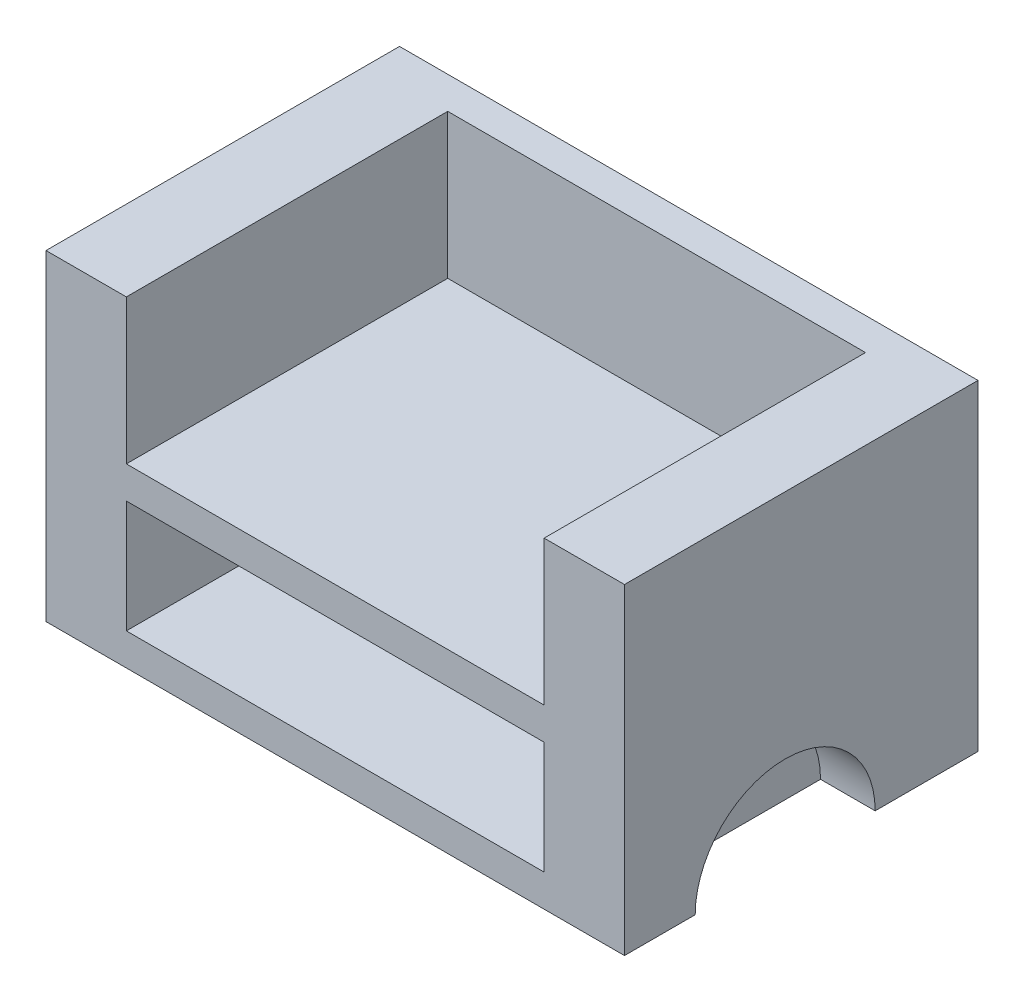
ISO-10303-21;
HEADER;
FILE_DESCRIPTION(('STEP AP214'),'2;1');
FILE_NAME('part.step','',(''),(''),'','','');
FILE_SCHEMA(('AUTOMOTIVE_DESIGN { 1 0 10303 214 1 1 1 1 }'));
ENDSEC;
DATA;
#1=APPLICATION_CONTEXT('core data for automotive mechanical design processes');
#2=APPLICATION_PROTOCOL_DEFINITION('international standard','automotive_design',2000,#1);
#3=PRODUCT_CONTEXT('',#1,'mechanical');
#4=PRODUCT('Part','Part','',(#3));
#5=PRODUCT_RELATED_PRODUCT_CATEGORY('part','',(#4));
#6=PRODUCT_DEFINITION_FORMATION('','',#4);
#7=PRODUCT_DEFINITION_CONTEXT('part definition',#1,'design');
#8=PRODUCT_DEFINITION('design','',#6,#7);
#9=PRODUCT_DEFINITION_SHAPE('','',#8);
#10=(LENGTH_UNIT() NAMED_UNIT(*) SI_UNIT(.MILLI.,.METRE.));
#11=(NAMED_UNIT(*) PLANE_ANGLE_UNIT() SI_UNIT($,.RADIAN.));
#12=(NAMED_UNIT(*) SI_UNIT($,.STERADIAN.) SOLID_ANGLE_UNIT());
#13=UNCERTAINTY_MEASURE_WITH_UNIT(LENGTH_MEASURE(1.E-05),#10,'distance_accuracy_value','');
#14=(GEOMETRIC_REPRESENTATION_CONTEXT(3) GLOBAL_UNCERTAINTY_ASSIGNED_CONTEXT((#13)) GLOBAL_UNIT_ASSIGNED_CONTEXT((#10,
#11,#12)) REPRESENTATION_CONTEXT('',''));
#15=CARTESIAN_POINT('',(0.,0.,0.));
#16=DIRECTION('',(0.,0.,1.));
#17=DIRECTION('',(1.,0.,0.));
#18=AXIS2_PLACEMENT_3D('',#15,#16,#17);
#19=CARTESIAN_POINT('',(25.,10.,-110.));
#20=DIRECTION('',(-1.,0.,0.));
#21=DIRECTION('',(0.,0.,1.));
#22=AXIS2_PLACEMENT_3D('',#19,#20,#21);
#23=PLANE('',#22);
#24=DIRECTION('',(0.,0.,-1.));
#25=VECTOR('',#24,1.);
#26=CARTESIAN_POINT('',(25.,45.,-9.99999999999999));
#27=LINE('',#26,#25);
#28=CARTESIAN_POINT('',(25.,45.,-10.));
#29=VERTEX_POINT('',#28);
#30=CARTESIAN_POINT('',(25.,45.,-110.));
#31=VERTEX_POINT('',#30);
#32=EDGE_CURVE('E199',#29,#31,#27,.T.);
#33=ORIENTED_EDGE('',*,*,#32,.F.);
#34=DIRECTION('',(0.,1.,0.));
#35=VECTOR('',#34,1.);
#36=CARTESIAN_POINT('',(25.,10.,-10.));
#37=LINE('',#36,#35);
#38=CARTESIAN_POINT('',(25.,10.,-10.));
#39=VERTEX_POINT('',#38);
#40=EDGE_CURVE('E170',#39,#29,#37,.T.);
#41=ORIENTED_EDGE('',*,*,#40,.F.);
#42=DIRECTION('',(0.,0.,1.));
#43=VECTOR('',#42,1.);
#44=CARTESIAN_POINT('',(25.,10.,-110.));
#45=LINE('',#44,#43);
#46=CARTESIAN_POINT('',(25.,10.,-110.));
#47=VERTEX_POINT('',#46);
#48=EDGE_CURVE('E253',#47,#39,#45,.T.);
#49=ORIENTED_EDGE('',*,*,#48,.F.);
#50=DIRECTION('',(0.,1.,0.));
#51=VECTOR('',#50,1.);
#52=CARTESIAN_POINT('',(25.,10.,-110.));
#53=LINE('',#52,#51);
#54=EDGE_CURVE('E280',#47,#31,#53,.T.);
#55=ORIENTED_EDGE('',*,*,#54,.T.);
#56=EDGE_LOOP('',(#33,#41,#49,#55));
#57=FACE_BOUND('',#56,.T.);
#58=ADVANCED_FACE('F43',(#57),#23,.F.);
#59=DIRECTION('',(0.,0.,-1.));
#60=VECTOR('',#59,1.);
#61=CARTESIAN_POINT('',(25.,55.,-9.99999999999999));
#62=LINE('',#61,#60);
#63=CARTESIAN_POINT('',(25.,55.,-10.));
#64=VERTEX_POINT('',#63);
#65=CARTESIAN_POINT('',(25.,55.,-110.));
#66=VERTEX_POINT('',#65);
#67=EDGE_CURVE('E59',#64,#66,#62,.T.);
#68=ORIENTED_EDGE('',*,*,#67,.T.);
#69=CARTESIAN_POINT('',(25.,100.,-110.));
#70=VERTEX_POINT('',#69);
#71=EDGE_CURVE('E284',#66,#70,#53,.T.);
#72=ORIENTED_EDGE('',*,*,#71,.T.);
#73=DIRECTION('',(0.,0.,1.));
#74=VECTOR('',#73,1.);
#75=CARTESIAN_POINT('',(25.,100.,-110.));
#76=LINE('',#75,#74);
#77=CARTESIAN_POINT('',(25.,100.,-10.));
#78=VERTEX_POINT('',#77);
#79=EDGE_CURVE('E249',#70,#78,#76,.T.);
#80=ORIENTED_EDGE('',*,*,#79,.T.);
#81=EDGE_CURVE('E270',#64,#78,#37,.T.);
#82=ORIENTED_EDGE('',*,*,#81,.F.);
#83=EDGE_LOOP('',(#68,#72,#80,#82));
#84=FACE_BOUND('',#83,.T.);
#85=ADVANCED_FACE('F368',(#84),#23,.F.);
#86=CARTESIAN_POINT('',(25.,10.,-110.));
#87=DIRECTION('',(0.,0.,-1.));
#88=DIRECTION('',(-1.,0.,0.));
#89=AXIS2_PLACEMENT_3D('',#86,#87,#88);
#90=PLANE('',#89);
#91=DIRECTION('',(1.,0.,0.));
#92=VECTOR('',#91,1.);
#93=CARTESIAN_POINT('',(25.,45.,-110.));
#94=LINE('',#93,#92);
#95=CARTESIAN_POINT('',(155.,45.,-110.));
#96=VERTEX_POINT('',#95);
#97=EDGE_CURVE('E67',#31,#96,#94,.T.);
#98=ORIENTED_EDGE('',*,*,#97,.F.);
#99=ORIENTED_EDGE('',*,*,#54,.F.);
#100=DIRECTION('',(-1.,0.,0.));
#101=VECTOR('',#100,1.);
#102=CARTESIAN_POINT('',(25.,10.,-110.));
#103=LINE('',#102,#101);
#104=CARTESIAN_POINT('',(155.,10.,-110.));
#105=VERTEX_POINT('',#104);
#106=EDGE_CURVE('E266',#105,#47,#103,.T.);
#107=ORIENTED_EDGE('',*,*,#106,.F.);
#108=DIRECTION('',(0.,1.,0.));
#109=VECTOR('',#108,1.);
#110=CARTESIAN_POINT('',(155.,10.,-110.));
#111=LINE('',#110,#109);
#112=EDGE_CURVE('E285',#105,#96,#111,.T.);
#113=ORIENTED_EDGE('',*,*,#112,.T.);
#114=EDGE_LOOP('',(#98,#99,#107,#113));
#115=FACE_BOUND('',#114,.T.);
#116=ADVANCED_FACE('F374',(#115),#90,.F.);
#117=DIRECTION('',(-1.,0.,0.));
#118=VECTOR('',#117,1.);
#119=CARTESIAN_POINT('',(25.,55.,-110.));
#120=LINE('',#119,#118);
#121=CARTESIAN_POINT('',(155.,55.,-110.));
#122=VERTEX_POINT('',#121);
#123=EDGE_CURVE('E190',#122,#66,#120,.T.);
#124=ORIENTED_EDGE('',*,*,#123,.F.);
#125=CARTESIAN_POINT('',(155.,100.,-110.));
#126=VERTEX_POINT('',#125);
#127=EDGE_CURVE('E176',#122,#126,#111,.T.);
#128=ORIENTED_EDGE('',*,*,#127,.T.);
#129=DIRECTION('',(-1.,0.,0.));
#130=VECTOR('',#129,1.);
#131=CARTESIAN_POINT('',(25.,100.,-110.));
#132=LINE('',#131,#130);
#133=EDGE_CURVE('E258',#126,#70,#132,.T.);
#134=ORIENTED_EDGE('',*,*,#133,.T.);
#135=ORIENTED_EDGE('',*,*,#71,.F.);
#136=EDGE_LOOP('',(#124,#128,#134,#135));
#137=FACE_BOUND('',#136,.T.);
#138=ADVANCED_FACE('F394',(#137),#90,.F.);
#139=CARTESIAN_POINT('',(155.,10.,-110.));
#140=DIRECTION('',(1.,0.,0.));
#141=DIRECTION('',(0.,0.,-1.));
#142=AXIS2_PLACEMENT_3D('',#139,#140,#141);
#143=PLANE('',#142);
#144=DIRECTION('',(0.,0.,-1.));
#145=VECTOR('',#144,1.);
#146=CARTESIAN_POINT('',(155.,45.,-9.99999999999999));
#147=LINE('',#146,#145);
#148=CARTESIAN_POINT('',(155.,45.,-10.));
#149=VERTEX_POINT('',#148);
#150=EDGE_CURVE('E180',#149,#96,#147,.T.);
#151=ORIENTED_EDGE('',*,*,#150,.T.);
#152=ORIENTED_EDGE('',*,*,#112,.F.);
#153=DIRECTION('',(0.,0.,-1.));
#154=VECTOR('',#153,1.);
#155=CARTESIAN_POINT('',(155.,10.,-110.));
#156=LINE('',#155,#154);
#157=CARTESIAN_POINT('',(155.,10.,-10.));
#158=VERTEX_POINT('',#157);
#159=EDGE_CURVE('E262',#158,#105,#156,.T.);
#160=ORIENTED_EDGE('',*,*,#159,.F.);
#161=DIRECTION('',(0.,1.,0.));
#162=VECTOR('',#161,1.);
#163=CARTESIAN_POINT('',(155.,10.,-10.));
#164=LINE('',#163,#162);
#165=EDGE_CURVE('E169',#158,#149,#164,.T.);
#166=ORIENTED_EDGE('',*,*,#165,.T.);
#167=EDGE_LOOP('',(#151,#152,#160,#166));
#168=FACE_BOUND('',#167,.T.);
#169=ADVANCED_FACE('F377',(#168),#143,.F.);
#170=DIRECTION('',(0.,0.,-1.));
#171=VECTOR('',#170,1.);
#172=CARTESIAN_POINT('',(155.,55.,-9.99999999999999));
#173=LINE('',#172,#171);
#174=CARTESIAN_POINT('',(155.,55.,-9.99999999999999));
#175=VERTEX_POINT('',#174);
#176=EDGE_CURVE('E174',#175,#122,#173,.T.);
#177=ORIENTED_EDGE('',*,*,#176,.F.);
#178=CARTESIAN_POINT('',(155.,100.,-10.));
#179=VERTEX_POINT('',#178);
#180=EDGE_CURVE('E158',#175,#179,#164,.T.);
#181=ORIENTED_EDGE('',*,*,#180,.T.);
#182=DIRECTION('',(0.,0.,-1.));
#183=VECTOR('',#182,1.);
#184=CARTESIAN_POINT('',(155.,100.,-110.));
#185=LINE('',#184,#183);
#186=EDGE_CURVE('E274',#179,#126,#185,.T.);
#187=ORIENTED_EDGE('',*,*,#186,.T.);
#188=ORIENTED_EDGE('',*,*,#127,.F.);
#189=EDGE_LOOP('',(#177,#181,#187,#188));
#190=FACE_BOUND('',#189,.T.);
#191=ADVANCED_FACE('F175',(#190),#143,.F.);
#192=CARTESIAN_POINT('',(0.,100.,-120.));
#193=DIRECTION('',(1.,0.,0.));
#194=DIRECTION('',(0.,0.,-1.));
#195=AXIS2_PLACEMENT_3D('',#192,#193,#194);
#196=PLANE('',#195);
#197=DIRECTION('',(0.,0.,1.));
#198=VECTOR('',#197,1.);
#199=CARTESIAN_POINT('',(0.,0.,-120.));
#200=LINE('',#199,#198);
#201=CARTESIAN_POINT('',(0.,0.,-32.));
#202=VERTEX_POINT('',#201);
#203=CARTESIAN_POINT('',(0.,0.,-10.));
#204=VERTEX_POINT('',#203);
#205=EDGE_CURVE('E283',#202,#204,#200,.T.);
#206=ORIENTED_EDGE('',*,*,#205,.T.);
#207=DIRECTION('',(0.,1.,0.));
#208=VECTOR('',#207,1.);
#209=CARTESIAN_POINT('',(0.,0.,-10.));
#210=LINE('',#209,#208);
#211=CARTESIAN_POINT('',(0.,100.,-10.));
#212=VERTEX_POINT('',#211);
#213=EDGE_CURVE('E211',#204,#212,#210,.T.);
#214=ORIENTED_EDGE('',*,*,#213,.T.);
#215=DIRECTION('',(0.,0.,1.));
#216=VECTOR('',#215,1.);
#217=CARTESIAN_POINT('',(0.,100.,-120.));
#218=LINE('',#217,#216);
#219=CARTESIAN_POINT('',(0.,100.,-120.));
#220=VERTEX_POINT('',#219);
#221=EDGE_CURVE('E292',#220,#212,#218,.T.);
#222=ORIENTED_EDGE('',*,*,#221,.F.);
#223=DIRECTION('',(0.,-1.,0.));
#224=VECTOR('',#223,1.);
#225=CARTESIAN_POINT('',(0.,100.,-120.));
#226=LINE('',#225,#224);
#227=CARTESIAN_POINT('',(0.,0.,-120.));
#228=VERTEX_POINT('',#227);
#229=EDGE_CURVE('E52',#220,#228,#226,.T.);
#230=ORIENTED_EDGE('',*,*,#229,.T.);
#231=CARTESIAN_POINT('',(0.,0.,-88.));
#232=VERTEX_POINT('',#231);
#233=EDGE_CURVE('E303',#228,#232,#200,.T.);
#234=ORIENTED_EDGE('',*,*,#233,.T.);
#235=CARTESIAN_POINT('',(0.,0.,-60.));
#236=DIRECTION('',(-1.,0.,0.));
#237=DIRECTION('',(0.,0.,-1.));
#238=AXIS2_PLACEMENT_3D('',#235,#236,#237);
#239=CIRCLE('',#238,28.);
#240=EDGE_CURVE('E215',#202,#232,#239,.T.);
#241=ORIENTED_EDGE('',*,*,#240,.F.);
#242=EDGE_LOOP('',(#206,#214,#222,#230,#234,#241));
#243=FACE_BOUND('',#242,.T.);
#244=ADVANCED_FACE('F45',(#243),#196,.F.);
#245=CARTESIAN_POINT('',(180.,100.,-120.));
#246=DIRECTION('',(-1.,0.,0.));
#247=DIRECTION('',(0.,0.,1.));
#248=AXIS2_PLACEMENT_3D('',#245,#246,#247);
#249=PLANE('',#248);
#250=DIRECTION('',(0.,0.,-1.));
#251=VECTOR('',#250,1.);
#252=CARTESIAN_POINT('',(180.,100.,-120.));
#253=LINE('',#252,#251);
#254=CARTESIAN_POINT('',(180.,100.,-10.));
#255=VERTEX_POINT('',#254);
#256=CARTESIAN_POINT('',(180.,100.,-120.));
#257=VERTEX_POINT('',#256);
#258=EDGE_CURVE('E296',#255,#257,#253,.T.);
#259=ORIENTED_EDGE('',*,*,#258,.F.);
#260=DIRECTION('',(0.,1.,0.));
#261=VECTOR('',#260,1.);
#262=CARTESIAN_POINT('',(180.,0.,-10.));
#263=LINE('',#262,#261);
#264=CARTESIAN_POINT('',(180.,0.,-10.));
#265=VERTEX_POINT('',#264);
#266=EDGE_CURVE('E208',#265,#255,#263,.T.);
#267=ORIENTED_EDGE('',*,*,#266,.F.);
#268=DIRECTION('',(0.,0.,-1.));
#269=VECTOR('',#268,1.);
#270=CARTESIAN_POINT('',(180.,0.,-120.));
#271=LINE('',#270,#269);
#272=CARTESIAN_POINT('',(180.,0.,-32.));
#273=VERTEX_POINT('',#272);
#274=EDGE_CURVE('E308',#265,#273,#271,.T.);
#275=ORIENTED_EDGE('',*,*,#274,.T.);
#276=CARTESIAN_POINT('',(180.,0.,-60.));
#277=DIRECTION('',(1.,0.,0.));
#278=DIRECTION('',(0.,0.,1.));
#279=AXIS2_PLACEMENT_3D('',#276,#277,#278);
#280=CIRCLE('',#279,28.);
#281=CARTESIAN_POINT('',(180.,0.,-88.));
#282=VERTEX_POINT('',#281);
#283=EDGE_CURVE('E231',#282,#273,#280,.T.);
#284=ORIENTED_EDGE('',*,*,#283,.F.);
#285=CARTESIAN_POINT('',(180.,0.,-120.));
#286=VERTEX_POINT('',#285);
#287=EDGE_CURVE('E307',#282,#286,#271,.T.);
#288=ORIENTED_EDGE('',*,*,#287,.T.);
#289=DIRECTION('',(0.,-1.,0.));
#290=VECTOR('',#289,1.);
#291=CARTESIAN_POINT('',(180.,100.,-120.));
#292=LINE('',#291,#290);
#293=EDGE_CURVE('E11',#257,#286,#292,.T.);
#294=ORIENTED_EDGE('',*,*,#293,.F.);
#295=EDGE_LOOP('',(#259,#267,#275,#284,#288,#294));
#296=FACE_BOUND('',#295,.T.);
#297=ADVANCED_FACE('F347',(#296),#249,.F.);
#298=CARTESIAN_POINT('',(0.,100.,-120.));
#299=DIRECTION('',(0.,0.,1.));
#300=DIRECTION('',(1.,0.,0.));
#301=AXIS2_PLACEMENT_3D('',#298,#299,#300);
#302=PLANE('',#301);
#303=DIRECTION('',(-1.,0.,0.));
#304=VECTOR('',#303,1.);
#305=CARTESIAN_POINT('',(0.,0.,-120.));
#306=LINE('',#305,#304);
#307=EDGE_CURVE('E297',#286,#228,#306,.T.);
#308=ORIENTED_EDGE('',*,*,#307,.T.);
#309=ORIENTED_EDGE('',*,*,#229,.F.);
#310=DIRECTION('',(-1.,0.,0.));
#311=VECTOR('',#310,1.);
#312=CARTESIAN_POINT('',(0.,100.,-120.));
#313=LINE('',#312,#311);
#314=EDGE_CURVE('E300',#257,#220,#313,.T.);
#315=ORIENTED_EDGE('',*,*,#314,.F.);
#316=ORIENTED_EDGE('',*,*,#293,.T.);
#317=EDGE_LOOP('',(#308,#309,#315,#316));
#318=FACE_BOUND('',#317,.T.);
#319=ADVANCED_FACE('F345',(#318),#302,.F.);
#320=CARTESIAN_POINT('',(0.,100.,0.));
#321=DIRECTION('',(0.,1.,0.));
#322=DIRECTION('',(0.,0.,1.));
#323=AXIS2_PLACEMENT_3D('',#320,#321,#322);
#324=PLANE('',#323);
#325=DIRECTION('',(-1.,0.,0.));
#326=VECTOR('',#325,1.);
#327=CARTESIAN_POINT('',(0.,100.,-10.));
#328=LINE('',#327,#326);
#329=EDGE_CURVE('E164',#255,#179,#328,.T.);
#330=ORIENTED_EDGE('',*,*,#329,.F.);
#331=ORIENTED_EDGE('',*,*,#258,.T.);
#332=ORIENTED_EDGE('',*,*,#314,.T.);
#333=ORIENTED_EDGE('',*,*,#221,.T.);
#334=EDGE_CURVE('E203',#78,#212,#328,.T.);
#335=ORIENTED_EDGE('',*,*,#334,.F.);
#336=ORIENTED_EDGE('',*,*,#79,.F.);
#337=ORIENTED_EDGE('',*,*,#133,.F.);
#338=ORIENTED_EDGE('',*,*,#186,.F.);
#339=EDGE_LOOP('',(#330,#331,#332,#333,#335,#336,#337,#338));
#340=FACE_BOUND('',#339,.T.);
#341=ADVANCED_FACE('F342',(#340),#324,.T.);
#342=CARTESIAN_POINT('',(0.,0.,0.));
#343=DIRECTION('',(0.,1.,0.));
#344=DIRECTION('',(0.,0.,1.));
#345=AXIS2_PLACEMENT_3D('',#342,#343,#344);
#346=PLANE('',#345);
#347=ORIENTED_EDGE('',*,*,#274,.F.);
#348=DIRECTION('',(-1.,0.,0.));
#349=VECTOR('',#348,1.);
#350=CARTESIAN_POINT('',(0.,0.,-10.));
#351=LINE('',#350,#349);
#352=EDGE_CURVE('E204',#265,#204,#351,.T.);
#353=ORIENTED_EDGE('',*,*,#352,.T.);
#354=ORIENTED_EDGE('',*,*,#205,.F.);
#355=DIRECTION('',(-1.,0.,0.));
#356=VECTOR('',#355,1.);
#357=CARTESIAN_POINT('',(17.,0.,-32.));
#358=LINE('',#357,#356);
#359=CARTESIAN_POINT('',(17.,0.,-32.));
#360=VERTEX_POINT('',#359);
#361=EDGE_CURVE('E228',#360,#202,#358,.T.);
#362=ORIENTED_EDGE('',*,*,#361,.F.);
#363=DIRECTION('',(0.,0.,1.));
#364=VECTOR('',#363,1.);
#365=CARTESIAN_POINT('',(17.,0.,-88.));
#366=LINE('',#365,#364);
#367=CARTESIAN_POINT('',(17.,0.,-88.));
#368=VERTEX_POINT('',#367);
#369=EDGE_CURVE('E221',#368,#360,#366,.T.);
#370=ORIENTED_EDGE('',*,*,#369,.F.);
#371=DIRECTION('',(-1.,0.,0.));
#372=VECTOR('',#371,1.);
#373=CARTESIAN_POINT('',(17.,0.,-88.));
#374=LINE('',#373,#372);
#375=EDGE_CURVE('E225',#368,#232,#374,.T.);
#376=ORIENTED_EDGE('',*,*,#375,.T.);
#377=ORIENTED_EDGE('',*,*,#233,.F.);
#378=ORIENTED_EDGE('',*,*,#307,.F.);
#379=ORIENTED_EDGE('',*,*,#287,.F.);
#380=DIRECTION('',(1.,0.,0.));
#381=VECTOR('',#380,1.);
#382=CARTESIAN_POINT('',(163.,0.,-88.));
#383=LINE('',#382,#381);
#384=CARTESIAN_POINT('',(163.,0.,-88.));
#385=VERTEX_POINT('',#384);
#386=EDGE_CURVE('E246',#385,#282,#383,.T.);
#387=ORIENTED_EDGE('',*,*,#386,.F.);
#388=DIRECTION('',(0.,0.,-1.));
#389=VECTOR('',#388,1.);
#390=CARTESIAN_POINT('',(163.,0.,-32.));
#391=LINE('',#390,#389);
#392=CARTESIAN_POINT('',(163.,0.,-32.));
#393=VERTEX_POINT('',#392);
#394=EDGE_CURVE('E238',#393,#385,#391,.T.);
#395=ORIENTED_EDGE('',*,*,#394,.F.);
#396=DIRECTION('',(1.,0.,0.));
#397=VECTOR('',#396,1.);
#398=CARTESIAN_POINT('',(163.,0.,-32.));
#399=LINE('',#398,#397);
#400=EDGE_CURVE('E242',#393,#273,#399,.T.);
#401=ORIENTED_EDGE('',*,*,#400,.T.);
#402=EDGE_LOOP('',(#347,#353,#354,#362,#370,#376,#377,#378,#379,#387,#395,#401));
#403=FACE_BOUND('',#402,.T.);
#404=ADVANCED_FACE('F325',(#403),#346,.F.);
#405=CARTESIAN_POINT('',(0.,10.,0.));
#406=DIRECTION('',(0.,1.,0.));
#407=DIRECTION('',(0.,0.,1.));
#408=AXIS2_PLACEMENT_3D('',#405,#406,#407);
#409=PLANE('',#408);
#410=ORIENTED_EDGE('',*,*,#48,.T.);
#411=DIRECTION('',(1.,0.,0.));
#412=VECTOR('',#411,1.);
#413=CARTESIAN_POINT('',(25.,10.,-10.));
#414=LINE('',#413,#412);
#415=EDGE_CURVE('E257',#39,#158,#414,.T.);
#416=ORIENTED_EDGE('',*,*,#415,.T.);
#417=ORIENTED_EDGE('',*,*,#159,.T.);
#418=ORIENTED_EDGE('',*,*,#106,.T.);
#419=EDGE_LOOP('',(#410,#416,#417,#418));
#420=FACE_BOUND('',#419,.T.);
#421=ADVANCED_FACE('F365',(#420),#409,.T.);
#422=CARTESIAN_POINT('',(163.,0.,-60.));
#423=DIRECTION('',(1.,0.,0.));
#424=DIRECTION('',(0.,0.,-1.));
#425=AXIS2_PLACEMENT_3D('',#422,#423,#424);
#426=CYLINDRICAL_SURFACE('',#425,28.);
#427=ORIENTED_EDGE('',*,*,#283,.T.);
#428=ORIENTED_EDGE('',*,*,#400,.F.);
#429=CARTESIAN_POINT('',(163.,0.,-60.));
#430=DIRECTION('',(1.,0.,0.));
#431=DIRECTION('',(0.,0.,1.));
#432=AXIS2_PLACEMENT_3D('',#429,#430,#431);
#433=CIRCLE('',#432,28.);
#434=EDGE_CURVE('E235',#385,#393,#433,.T.);
#435=ORIENTED_EDGE('',*,*,#434,.F.);
#436=ORIENTED_EDGE('',*,*,#386,.T.);
#437=EDGE_LOOP('',(#427,#428,#435,#436));
#438=FACE_BOUND('',#437,.T.);
#439=ADVANCED_FACE('F353',(#438),#426,.F.);
#440=CARTESIAN_POINT('',(163.,0.,-60.));
#441=DIRECTION('',(-1.,0.,0.));
#442=DIRECTION('',(0.,0.,1.));
#443=AXIS2_PLACEMENT_3D('',#440,#441,#442);
#444=PLANE('',#443);
#445=ORIENTED_EDGE('',*,*,#434,.T.);
#446=ORIENTED_EDGE('',*,*,#394,.T.);
#447=EDGE_LOOP('',(#445,#446));
#448=FACE_BOUND('',#447,.T.);
#449=ADVANCED_FACE('F356',(#448),#444,.F.);
#450=CARTESIAN_POINT('',(17.,0.,-60.));
#451=DIRECTION('',(-1.,0.,0.));
#452=DIRECTION('',(0.,0.,1.));
#453=AXIS2_PLACEMENT_3D('',#450,#451,#452);
#454=CYLINDRICAL_SURFACE('',#453,28.);
#455=ORIENTED_EDGE('',*,*,#240,.T.);
#456=ORIENTED_EDGE('',*,*,#375,.F.);
#457=CARTESIAN_POINT('',(17.,0.,-60.));
#458=DIRECTION('',(-1.,0.,0.));
#459=DIRECTION('',(0.,0.,-1.));
#460=AXIS2_PLACEMENT_3D('',#457,#458,#459);
#461=CIRCLE('',#460,28.);
#462=EDGE_CURVE('E218',#360,#368,#461,.T.);
#463=ORIENTED_EDGE('',*,*,#462,.F.);
#464=ORIENTED_EDGE('',*,*,#361,.T.);
#465=EDGE_LOOP('',(#455,#456,#463,#464));
#466=FACE_BOUND('',#465,.T.);
#467=ADVANCED_FACE('F331',(#466),#454,.F.);
#468=CARTESIAN_POINT('',(17.,0.,-60.));
#469=DIRECTION('',(1.,0.,0.));
#470=DIRECTION('',(0.,0.,-1.));
#471=AXIS2_PLACEMENT_3D('',#468,#469,#470);
#472=PLANE('',#471);
#473=ORIENTED_EDGE('',*,*,#462,.T.);
#474=ORIENTED_EDGE('',*,*,#369,.T.);
#475=EDGE_LOOP('',(#473,#474));
#476=FACE_BOUND('',#475,.T.);
#477=ADVANCED_FACE('F363',(#476),#472,.F.);
#478=CARTESIAN_POINT('',(0.,0.,-10.));
#479=DIRECTION('',(0.,0.,-1.));
#480=DIRECTION('',(-1.,0.,0.));
#481=AXIS2_PLACEMENT_3D('',#478,#479,#480);
#482=PLANE('',#481);
#483=ORIENTED_EDGE('',*,*,#40,.T.);
#484=DIRECTION('',(1.,0.,0.));
#485=VECTOR('',#484,1.);
#486=CARTESIAN_POINT('',(25.,45.,-9.99999999999999));
#487=LINE('',#486,#485);
#488=EDGE_CURVE('E184',#29,#149,#487,.T.);
#489=ORIENTED_EDGE('',*,*,#488,.T.);
#490=ORIENTED_EDGE('',*,*,#165,.F.);
#491=ORIENTED_EDGE('',*,*,#415,.F.);
#492=EDGE_LOOP('',(#483,#489,#490,#491));
#493=FACE_BOUND('',#492,.T.);
#494=ORIENTED_EDGE('',*,*,#334,.T.);
#495=ORIENTED_EDGE('',*,*,#213,.F.);
#496=ORIENTED_EDGE('',*,*,#352,.F.);
#497=ORIENTED_EDGE('',*,*,#266,.T.);
#498=ORIENTED_EDGE('',*,*,#329,.T.);
#499=ORIENTED_EDGE('',*,*,#180,.F.);
#500=DIRECTION('',(-1.,0.,0.));
#501=VECTOR('',#500,1.);
#502=CARTESIAN_POINT('',(25.,55.,-9.99999999999999));
#503=LINE('',#502,#501);
#504=EDGE_CURVE('E162',#175,#64,#503,.T.);
#505=ORIENTED_EDGE('',*,*,#504,.T.);
#506=ORIENTED_EDGE('',*,*,#81,.T.);
#507=EDGE_LOOP('',(#494,#495,#496,#497,#498,#499,#505,#506));
#508=FACE_BOUND('',#507,.T.);
#509=ADVANCED_FACE('F160',(#493,#508),#482,.F.);
#510=CARTESIAN_POINT('',(25.,45.,-9.99999999999999));
#511=DIRECTION('',(0.,1.,0.));
#512=DIRECTION('',(0.,0.,1.));
#513=AXIS2_PLACEMENT_3D('',#510,#511,#512);
#514=PLANE('',#513);
#515=ORIENTED_EDGE('',*,*,#97,.T.);
#516=ORIENTED_EDGE('',*,*,#150,.F.);
#517=ORIENTED_EDGE('',*,*,#488,.F.);
#518=ORIENTED_EDGE('',*,*,#32,.T.);
#519=EDGE_LOOP('',(#515,#516,#517,#518));
#520=FACE_BOUND('',#519,.T.);
#521=ADVANCED_FACE('F405',(#520),#514,.F.);
#522=CARTESIAN_POINT('',(25.,55.,-9.99999999999999));
#523=DIRECTION('',(0.,-1.,0.));
#524=DIRECTION('',(1.,0.,0.));
#525=AXIS2_PLACEMENT_3D('',#522,#523,#524);
#526=PLANE('',#525);
#527=ORIENTED_EDGE('',*,*,#123,.T.);
#528=ORIENTED_EDGE('',*,*,#67,.F.);
#529=ORIENTED_EDGE('',*,*,#504,.F.);
#530=ORIENTED_EDGE('',*,*,#176,.T.);
#531=EDGE_LOOP('',(#527,#528,#529,#530));
#532=FACE_BOUND('',#531,.T.);
#533=ADVANCED_FACE('F182',(#532),#526,.F.);
#534=CLOSED_SHELL('',(#58,#85,#116,#138,#169,#191,#244,#297,#319,#341,#404,#421,#439,#449,#467,
#477,#509,#521,#533));
#535=MANIFOLD_SOLID_BREP('B2',#534);
#536=ADVANCED_BREP_SHAPE_REPRESENTATION('',(#18,#535),#14);
#537=SHAPE_DEFINITION_REPRESENTATION(#9,#536);
ENDSEC;
END-ISO-10303-21;
